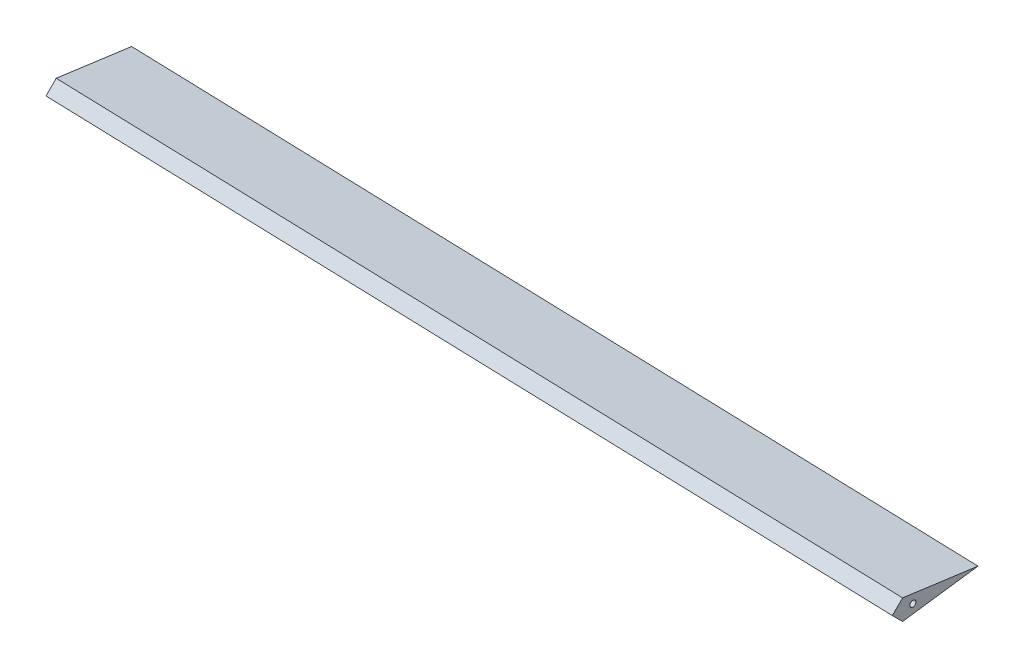
ISO-10303-21;
HEADER;
FILE_DESCRIPTION(('STEP AP214'),'2;1');
FILE_NAME('part.step','',(''),(''),'','','');
FILE_SCHEMA(('AUTOMOTIVE_DESIGN { 1 0 10303 214 1 1 1 1 }'));
ENDSEC;
DATA;
#1=APPLICATION_CONTEXT('core data for automotive mechanical design processes');
#2=APPLICATION_PROTOCOL_DEFINITION('international standard','automotive_design',2000,#1);
#3=PRODUCT_CONTEXT('',#1,'mechanical');
#4=PRODUCT('Part','Part','',(#3));
#5=PRODUCT_RELATED_PRODUCT_CATEGORY('part','',(#4));
#6=PRODUCT_DEFINITION_FORMATION('','',#4);
#7=PRODUCT_DEFINITION_CONTEXT('part definition',#1,'design');
#8=PRODUCT_DEFINITION('design','',#6,#7);
#9=PRODUCT_DEFINITION_SHAPE('','',#8);
#10=(LENGTH_UNIT() NAMED_UNIT(*) SI_UNIT(.MILLI.,.METRE.));
#11=(NAMED_UNIT(*) PLANE_ANGLE_UNIT() SI_UNIT($,.RADIAN.));
#12=(NAMED_UNIT(*) SI_UNIT($,.STERADIAN.) SOLID_ANGLE_UNIT());
#13=UNCERTAINTY_MEASURE_WITH_UNIT(LENGTH_MEASURE(1.E-05),#10,'distance_accuracy_value','');
#14=(GEOMETRIC_REPRESENTATION_CONTEXT(3) GLOBAL_UNCERTAINTY_ASSIGNED_CONTEXT((#13)) GLOBAL_UNIT_ASSIGNED_CONTEXT((#10,
#11,#12)) REPRESENTATION_CONTEXT('',''));
#15=CARTESIAN_POINT('',(0.,0.,0.));
#16=DIRECTION('',(0.,0.,1.));
#17=DIRECTION('',(1.,0.,0.));
#18=AXIS2_PLACEMENT_3D('',#15,#16,#17);
#19=CARTESIAN_POINT('',(402.631826605969,-10.8469322525921,92.3770961577892));
#20=DIRECTION('',(-0.00413017231978283,0.990924502757163,0.134356136860506));
#21=DIRECTION('',(0.,-0.134357282820383,0.990932954620606));
#22=AXIS2_PLACEMENT_3D('',#19,#20,#21);
#23=PLANE('',#22);
#24=DIRECTION('',(0.,0.134357282820383,-0.990932954620606));
#25=VECTOR('',#24,1.);
#26=CARTESIAN_POINT('',(402.631826605969,-10.8469322525921,92.3770961577892));
#27=LINE('',#26,#25);
#28=CARTESIAN_POINT('',(402.631826605969,-9.43184514420549,81.9403232495897));
#29=VERTEX_POINT('',#28);
#30=CARTESIAN_POINT('',(402.631826605969,0.,12.3770961577892));
#31=VERTEX_POINT('',#30);
#32=EDGE_CURVE('E59',#29,#31,#27,.T.);
#33=ORIENTED_EDGE('',*,*,#32,.F.);
#34=DIRECTION('',(-0.999527846007828,0.,-0.0307259671117202));
#35=VECTOR('',#34,1.);
#36=CARTESIAN_POINT('',(402.952355136784,-9.43184514420549,81.9501764509142));
#37=LINE('',#36,#35);
#38=CARTESIAN_POINT('',(-402.631826605969,-9.43184514420548,57.1861309340112));
#39=VERTEX_POINT('',#38);
#40=EDGE_CURVE('E78',#29,#39,#37,.T.);
#41=ORIENTED_EDGE('',*,*,#40,.T.);
#42=DIRECTION('',(0.,0.134357282820383,-0.990932954620606));
#43=VECTOR('',#42,1.);
#44=CARTESIAN_POINT('',(-402.631826605969,-10.8469322525921,67.6229038422108));
#45=LINE('',#44,#43);
#46=CARTESIAN_POINT('',(-402.631826605969,0.,-12.3770961577892));
#47=VERTEX_POINT('',#46);
#48=EDGE_CURVE('E97',#39,#47,#45,.T.);
#49=ORIENTED_EDGE('',*,*,#48,.T.);
#50=DIRECTION('',(-0.999527846007829,0.,-0.0307259671117202));
#51=VECTOR('',#50,1.);
#52=CARTESIAN_POINT('',(402.631826605969,0.,12.3770961577892));
#53=LINE('',#52,#51);
#54=EDGE_CURVE('E101',#31,#47,#53,.T.);
#55=ORIENTED_EDGE('',*,*,#54,.F.);
#56=EDGE_LOOP('',(#33,#41,#49,#55));
#57=FACE_BOUND('',#56,.T.);
#58=ADVANCED_FACE('F35',(#57),#23,.F.);
#59=CARTESIAN_POINT('',(402.631826605969,10.8469322525921,92.3770961577892));
#60=DIRECTION('',(-0.00413017231978283,-0.990924502757163,0.134356136860506));
#61=DIRECTION('',(0.,-0.134357282820383,-0.990932954620606));
#62=AXIS2_PLACEMENT_3D('',#59,#60,#61);
#63=PLANE('',#62);
#64=DIRECTION('',(0.,0.134357282820383,0.990932954620606));
#65=VECTOR('',#64,1.);
#66=CARTESIAN_POINT('',(-402.631826605969,10.8469322525921,67.6229038422108));
#67=LINE('',#66,#65);
#68=CARTESIAN_POINT('',(-402.631826605969,9.43184514420549,57.1861309340112));
#69=VERTEX_POINT('',#68);
#70=EDGE_CURVE('E99',#47,#69,#67,.T.);
#71=ORIENTED_EDGE('',*,*,#70,.T.);
#72=DIRECTION('',(0.999527846007829,0.,0.0307259671117202));
#73=VECTOR('',#72,1.);
#74=CARTESIAN_POINT('',(402.952355136784,9.43184514420549,81.9501764509142));
#75=LINE('',#74,#73);
#76=CARTESIAN_POINT('',(402.631826605969,9.43184514420549,81.9403232495896));
#77=VERTEX_POINT('',#76);
#78=EDGE_CURVE('E80',#69,#77,#75,.T.);
#79=ORIENTED_EDGE('',*,*,#78,.T.);
#80=DIRECTION('',(0.,0.134357282820383,0.990932954620606));
#81=VECTOR('',#80,1.);
#82=CARTESIAN_POINT('',(402.631826605969,10.8469322525921,92.3770961577892));
#83=LINE('',#82,#81);
#84=EDGE_CURVE('E89',#31,#77,#83,.T.);
#85=ORIENTED_EDGE('',*,*,#84,.F.);
#86=ORIENTED_EDGE('',*,*,#54,.T.);
#87=EDGE_LOOP('',(#71,#79,#85,#86));
#88=FACE_BOUND('',#87,.T.);
#89=ADVANCED_FACE('F115',(#88),#63,.F.);
#90=CARTESIAN_POINT('',(402.631826605969,0.,12.3770961577892));
#91=DIRECTION('',(1.,0.,0.));
#92=DIRECTION('',(0.,0.,-1.));
#93=AXIS2_PLACEMENT_3D('',#90,#91,#92);
#94=PLANE('',#93);
#95=CARTESIAN_POINT('',(402.631826605969,0.,72.4054387794015));
#96=DIRECTION('',(1.,0.,0.));
#97=DIRECTION('',(0.,0.,-1.));
#98=AXIS2_PLACEMENT_3D('',#95,#96,#97);
#99=ELLIPSE('',#98,2.75129903682389,2.75);
#100=CARTESIAN_POINT('',(402.631826605969,0.,69.6541397425776));
#101=VERTEX_POINT('',#100);
#102=EDGE_CURVE('E92',#101,#101,#99,.T.);
#103=ORIENTED_EDGE('',*,*,#102,.F.);
#104=EDGE_LOOP('',(#103));
#105=FACE_BOUND('',#104,.T.);
#106=DIRECTION('',(0.,0.706939790414691,-0.707273732531071));
#107=VECTOR('',#106,1.);
#108=CARTESIAN_POINT('',(402.631826605969,39.4997594065781,51.8582055952733));
#109=LINE('',#108,#107);
#110=CARTESIAN_POINT('',(402.631826605969,0.,91.3766237807624));
#111=VERTEX_POINT('',#110);
#112=EDGE_CURVE('E84',#111,#77,#109,.T.);
#113=ORIENTED_EDGE('',*,*,#112,.F.);
#114=DIRECTION('',(0.,0.706939790414691,0.707273732531071));
#115=VECTOR('',#114,1.);
#116=CARTESIAN_POINT('',(402.631826605969,-39.4997594065781,51.8582055952733));
#117=LINE('',#116,#115);
#118=EDGE_CURVE('E75',#29,#111,#117,.T.);
#119=ORIENTED_EDGE('',*,*,#118,.F.);
#120=ORIENTED_EDGE('',*,*,#32,.T.);
#121=ORIENTED_EDGE('',*,*,#84,.T.);
#122=EDGE_LOOP('',(#113,#119,#120,#121));
#123=FACE_BOUND('',#122,.T.);
#124=ADVANCED_FACE('F88',(#105,#123),#94,.T.);
#125=CARTESIAN_POINT('',(-402.631826605969,0.,-12.3770961577892));
#126=DIRECTION('',(1.,0.,0.));
#127=DIRECTION('',(0.,0.,-1.));
#128=AXIS2_PLACEMENT_3D('',#125,#126,#127);
#129=PLANE('',#128);
#130=CARTESIAN_POINT('',(-402.631826605969,0.,47.651246463823));
#131=DIRECTION('',(1.,0.,0.));
#132=DIRECTION('',(0.,0.,-1.));
#133=AXIS2_PLACEMENT_3D('',#130,#131,#132);
#134=ELLIPSE('',#133,2.75129903682389,2.75);
#135=CARTESIAN_POINT('',(-402.631826605969,0.,44.8999474269991));
#136=VERTEX_POINT('',#135);
#137=EDGE_CURVE('E38',#136,#136,#134,.T.);
#138=ORIENTED_EDGE('',*,*,#137,.T.);
#139=EDGE_LOOP('',(#138));
#140=FACE_BOUND('',#139,.T.);
#141=DIRECTION('',(0.,0.706939790414691,0.707273732531071));
#142=VECTOR('',#141,1.);
#143=CARTESIAN_POINT('',(-402.631826605969,-39.4997594065781,27.1040132796948));
#144=LINE('',#143,#142);
#145=CARTESIAN_POINT('',(-402.631826605969,0.,66.6224314651839));
#146=VERTEX_POINT('',#145);
#147=EDGE_CURVE('E43',#39,#146,#144,.T.);
#148=ORIENTED_EDGE('',*,*,#147,.T.);
#149=DIRECTION('',(0.,0.706939790414691,-0.707273732531071));
#150=VECTOR('',#149,1.);
#151=CARTESIAN_POINT('',(-402.631826605969,39.4997594065781,27.1040132796948));
#152=LINE('',#151,#150);
#153=EDGE_CURVE('E11',#146,#69,#152,.T.);
#154=ORIENTED_EDGE('',*,*,#153,.T.);
#155=ORIENTED_EDGE('',*,*,#70,.F.);
#156=ORIENTED_EDGE('',*,*,#48,.F.);
#157=EDGE_LOOP('',(#148,#154,#155,#156));
#158=FACE_BOUND('',#157,.T.);
#159=ADVANCED_FACE('F109',(#140,#158),#129,.F.);
#160=CARTESIAN_POINT('',(402.995835056737,10.8469322525921,80.5357574815551));
#161=DIRECTION('',(0.0217265397032121,-0.707106781186551,-0.706772917896915));
#162=DIRECTION('',(0.,0.706939790414691,-0.707273732531071));
#163=AXIS2_PLACEMENT_3D('',#160,#161,#162);
#164=PLANE('',#163);
#165=ORIENTED_EDGE('',*,*,#112,.T.);
#166=ORIENTED_EDGE('',*,*,#78,.F.);
#167=ORIENTED_EDGE('',*,*,#153,.F.);
#168=DIRECTION('',(-0.999527846007829,0.,-0.0307259671117202));
#169=VECTOR('',#168,1.);
#170=CARTESIAN_POINT('',(402.66255257308,0.,91.3775683117814));
#171=LINE('',#170,#169);
#172=EDGE_CURVE('E50',#111,#146,#171,.T.);
#173=ORIENTED_EDGE('',*,*,#172,.F.);
#174=EDGE_LOOP('',(#165,#166,#167,#173));
#175=FACE_BOUND('',#174,.T.);
#176=ADVANCED_FACE('F83',(#175),#164,.F.);
#177=CARTESIAN_POINT('',(402.66255257308,0.,91.3775683117814));
#178=DIRECTION('',(0.0217265397032121,0.707106781186551,-0.706772917896915));
#179=DIRECTION('',(0.,0.706939790414691,0.707273732531071));
#180=AXIS2_PLACEMENT_3D('',#177,#178,#179);
#181=PLANE('',#180);
#182=ORIENTED_EDGE('',*,*,#118,.T.);
#183=ORIENTED_EDGE('',*,*,#172,.T.);
#184=ORIENTED_EDGE('',*,*,#147,.F.);
#185=ORIENTED_EDGE('',*,*,#40,.F.);
#186=EDGE_LOOP('',(#182,#183,#184,#185));
#187=FACE_BOUND('',#186,.T.);
#188=ADVANCED_FACE('F76',(#187),#181,.F.);
#189=CARTESIAN_POINT('',(403.24518535716,0.,72.424293722655));
#190=DIRECTION('',(-0.999527846007829,0.,-0.0307259671117202));
#191=DIRECTION('',(-0.0307259671117202,0.,0.999527846007829));
#192=AXIS2_PLACEMENT_3D('',#189,#190,#191);
#193=CYLINDRICAL_SURFACE('',#192,2.75);
#194=ORIENTED_EDGE('',*,*,#102,.T.);
#195=EDGE_LOOP('',(#194));
#196=FACE_BOUND('',#195,.T.);
#197=ORIENTED_EDGE('',*,*,#137,.F.);
#198=EDGE_LOOP('',(#197));
#199=FACE_BOUND('',#198,.T.);
#200=ADVANCED_FACE('F131',(#196,#199),#193,.F.);
#201=CLOSED_SHELL('',(#58,#89,#124,#159,#176,#188,#200));
#202=MANIFOLD_SOLID_BREP('B2',#201);
#203=ADVANCED_BREP_SHAPE_REPRESENTATION('',(#18,#202),#14);
#204=SHAPE_DEFINITION_REPRESENTATION(#9,#203);
ENDSEC;
END-ISO-10303-21;
